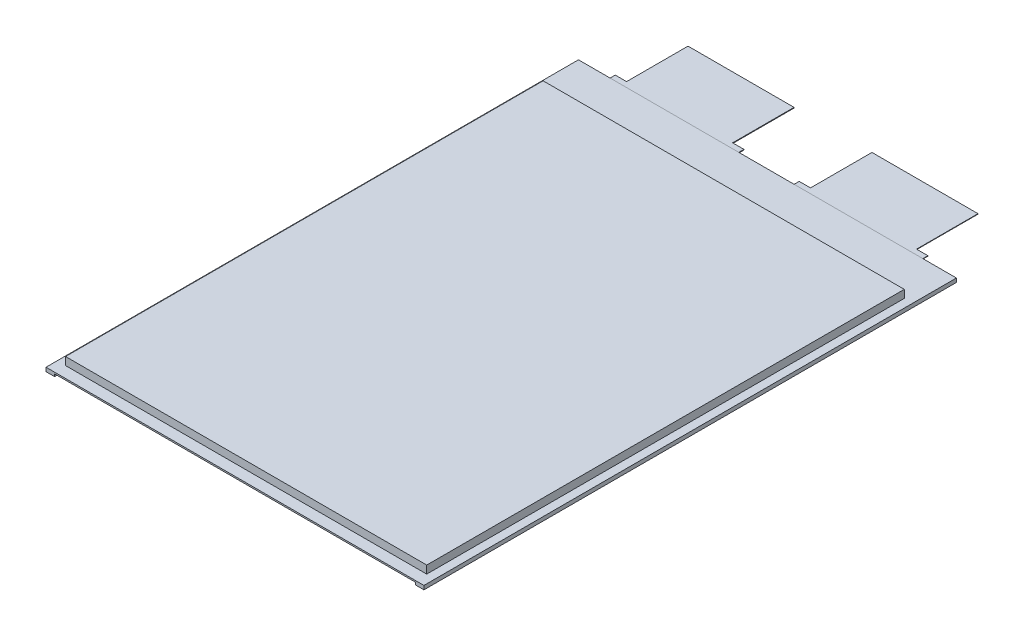
ISO-10303-21;
HEADER;
FILE_DESCRIPTION(('STEP AP214'),'2;1');
FILE_NAME('part.step','',(''),(''),'','','');
FILE_SCHEMA(('AUTOMOTIVE_DESIGN { 1 0 10303 214 1 1 1 1 }'));
ENDSEC;
DATA;
#1=APPLICATION_CONTEXT('core data for automotive mechanical design processes');
#2=APPLICATION_PROTOCOL_DEFINITION('international standard','automotive_design',2000,#1);
#3=PRODUCT_CONTEXT('',#1,'mechanical');
#4=PRODUCT('Part','Part','',(#3));
#5=PRODUCT_RELATED_PRODUCT_CATEGORY('part','',(#4));
#6=PRODUCT_DEFINITION_FORMATION('','',#4);
#7=PRODUCT_DEFINITION_CONTEXT('part definition',#1,'design');
#8=PRODUCT_DEFINITION('design','',#6,#7);
#9=PRODUCT_DEFINITION_SHAPE('','',#8);
#10=(LENGTH_UNIT() NAMED_UNIT(*) SI_UNIT(.MILLI.,.METRE.));
#11=(NAMED_UNIT(*) PLANE_ANGLE_UNIT() SI_UNIT($,.RADIAN.));
#12=(NAMED_UNIT(*) SI_UNIT($,.STERADIAN.) SOLID_ANGLE_UNIT());
#13=UNCERTAINTY_MEASURE_WITH_UNIT(LENGTH_MEASURE(1.E-05),#10,'distance_accuracy_value','');
#14=(GEOMETRIC_REPRESENTATION_CONTEXT(3) GLOBAL_UNCERTAINTY_ASSIGNED_CONTEXT((#13)) GLOBAL_UNIT_ASSIGNED_CONTEXT((#10,
#11,#12)) REPRESENTATION_CONTEXT('',''));
#15=CARTESIAN_POINT('',(0.,0.,0.));
#16=DIRECTION('',(0.,0.,1.));
#17=DIRECTION('',(1.,0.,0.));
#18=AXIS2_PLACEMENT_3D('',#15,#16,#17);
#19=CARTESIAN_POINT('',(0.,-0.3175,0.));
#20=DIRECTION('',(0.,1.,0.));
#21=DIRECTION('',(0.,0.,1.));
#22=AXIS2_PLACEMENT_3D('',#19,#20,#21);
#23=PLANE('',#22);
#24=DIRECTION('',(1.,0.,0.));
#25=VECTOR('',#24,1.);
#26=CARTESIAN_POINT('',(0.,-0.3175,-227.0125));
#27=LINE('',#26,#25);
#28=CARTESIAN_POINT('',(3.683,-0.3175,-227.0125));
#29=VERTEX_POINT('',#28);
#30=CARTESIAN_POINT('',(157.44825,-0.3175,-227.0125));
#31=VERTEX_POINT('',#30);
#32=EDGE_CURVE('E509',#29,#31,#27,.T.);
#33=ORIENTED_EDGE('',*,*,#32,.T.);
#34=DIRECTION('',(0.,0.,1.));
#35=VECTOR('',#34,1.);
#36=CARTESIAN_POINT('',(157.44825,-0.3175,-227.0125));
#37=LINE('',#36,#35);
#38=CARTESIAN_POINT('',(157.44825,-0.3175,-208.359375));
#39=VERTEX_POINT('',#38);
#40=EDGE_CURVE('E289',#31,#39,#37,.T.);
#41=ORIENTED_EDGE('',*,*,#40,.T.);
#42=DIRECTION('',(1.,0.,0.));
#43=VECTOR('',#42,1.);
#44=CARTESIAN_POINT('',(0.,-0.3175,-208.359375));
#45=LINE('',#44,#43);
#46=CARTESIAN_POINT('',(3.683,-0.3175,-208.359375));
#47=VERTEX_POINT('',#46);
#48=EDGE_CURVE('E528',#47,#39,#45,.T.);
#49=ORIENTED_EDGE('',*,*,#48,.F.);
#50=DIRECTION('',(0.,0.,1.));
#51=VECTOR('',#50,1.);
#52=CARTESIAN_POINT('',(3.683,-0.3175,-227.0125));
#53=LINE('',#52,#51);
#54=EDGE_CURVE('E320',#29,#47,#53,.T.);
#55=ORIENTED_EDGE('',*,*,#54,.F.);
#56=EDGE_LOOP('',(#33,#41,#49,#55));
#57=FACE_BOUND('',#56,.T.);
#58=ADVANCED_FACE('F36',(#57),#23,.F.);
#59=CARTESIAN_POINT('',(157.559375,-3.4163,0.));
#60=DIRECTION('',(1.,0.,0.));
#61=DIRECTION('',(0.,0.,-1.));
#62=AXIS2_PLACEMENT_3D('',#59,#60,#61);
#63=PLANE('',#62);
#64=DIRECTION('',(0.,1.,0.));
#65=VECTOR('',#64,1.);
#66=CARTESIAN_POINT('',(157.559375,-3.4163,-208.359375));
#67=LINE('',#66,#65);
#68=CARTESIAN_POINT('',(157.559375,-3.4163,-208.359375));
#69=VERTEX_POINT('',#68);
#70=CARTESIAN_POINT('',(157.559375,-1.3335,-208.359375));
#71=VERTEX_POINT('',#70);
#72=EDGE_CURVE('E498',#69,#71,#67,.T.);
#73=ORIENTED_EDGE('',*,*,#72,.T.);
#74=DIRECTION('',(0.,0.,1.));
#75=VECTOR('',#74,1.);
#76=CARTESIAN_POINT('',(157.559375,-1.3335,0.));
#77=LINE('',#76,#75);
#78=CARTESIAN_POINT('',(157.559375,-1.3335,-4.7625));
#79=VERTEX_POINT('',#78);
#80=EDGE_CURVE('E11',#71,#79,#77,.T.);
#81=ORIENTED_EDGE('',*,*,#80,.T.);
#82=DIRECTION('',(0.,1.,0.));
#83=VECTOR('',#82,1.);
#84=CARTESIAN_POINT('',(157.559375,-3.4163,-4.7625));
#85=LINE('',#84,#83);
#86=CARTESIAN_POINT('',(157.559375,-3.4163,-4.7625));
#87=VERTEX_POINT('',#86);
#88=EDGE_CURVE('E502',#87,#79,#85,.T.);
#89=ORIENTED_EDGE('',*,*,#88,.F.);
#90=DIRECTION('',(0.,0.,-1.));
#91=VECTOR('',#90,1.);
#92=CARTESIAN_POINT('',(157.559375,-3.4163,0.));
#93=LINE('',#92,#91);
#94=EDGE_CURVE('E481',#87,#69,#93,.T.);
#95=ORIENTED_EDGE('',*,*,#94,.T.);
#96=EDGE_LOOP('',(#73,#81,#89,#95));
#97=FACE_BOUND('',#96,.T.);
#98=ADVANCED_FACE('F583',(#97),#63,.T.);
#99=DIRECTION('',(1.,0.,0.));
#100=VECTOR('',#99,1.);
#101=CARTESIAN_POINT('',(0.,-0.3175,-4.7625));
#102=LINE('',#101,#100);
#103=CARTESIAN_POINT('',(3.683,-0.3175,-4.7625));
#104=VERTEX_POINT('',#103);
#105=CARTESIAN_POINT('',(157.44825,-0.3175,-4.7625));
#106=VERTEX_POINT('',#105);
#107=EDGE_CURVE('E492',#104,#106,#102,.T.);
#108=ORIENTED_EDGE('',*,*,#107,.T.);
#109=CARTESIAN_POINT('',(157.44825,-0.3175,0.));
#110=VERTEX_POINT('',#109);
#111=EDGE_CURVE('E304',#106,#110,#37,.T.);
#112=ORIENTED_EDGE('',*,*,#111,.T.);
#113=DIRECTION('',(1.,0.,0.));
#114=VECTOR('',#113,1.);
#115=CARTESIAN_POINT('',(0.,-0.3175,0.));
#116=LINE('',#115,#114);
#117=CARTESIAN_POINT('',(3.683,-0.3175,0.));
#118=VERTEX_POINT('',#117);
#119=EDGE_CURVE('E531',#118,#110,#116,.T.);
#120=ORIENTED_EDGE('',*,*,#119,.F.);
#121=EDGE_CURVE('E315',#104,#118,#53,.T.);
#122=ORIENTED_EDGE('',*,*,#121,.F.);
#123=EDGE_LOOP('',(#108,#112,#120,#122));
#124=FACE_BOUND('',#123,.T.);
#125=ADVANCED_FACE('F551',(#124),#23,.F.);
#126=CARTESIAN_POINT('',(0.,-3.4163,-208.359375));
#127=DIRECTION('',(0.,0.,1.));
#128=DIRECTION('',(1.,0.,0.));
#129=AXIS2_PLACEMENT_3D('',#126,#127,#128);
#130=PLANE('',#129);
#131=ORIENTED_EDGE('',*,*,#48,.T.);
#132=DIRECTION('',(0.,-1.,0.));
#133=VECTOR('',#132,1.);
#134=CARTESIAN_POINT('',(157.44825,-3.4163,-208.359375));
#135=LINE('',#134,#133);
#136=CARTESIAN_POINT('',(157.44825,-1.3335,-208.359375));
#137=VERTEX_POINT('',#136);
#138=EDGE_CURVE('E312',#39,#137,#135,.T.);
#139=ORIENTED_EDGE('',*,*,#138,.T.);
#140=DIRECTION('',(-1.,0.,0.));
#141=VECTOR('',#140,1.);
#142=CARTESIAN_POINT('',(0.,-1.3335,-208.359375));
#143=LINE('',#142,#141);
#144=EDGE_CURVE('E308',#71,#137,#143,.T.);
#145=ORIENTED_EDGE('',*,*,#144,.F.);
#146=ORIENTED_EDGE('',*,*,#72,.F.);
#147=DIRECTION('',(1.,0.,0.));
#148=VECTOR('',#147,1.);
#149=CARTESIAN_POINT('',(0.,-3.4163,-208.359375));
#150=LINE('',#149,#148);
#151=CARTESIAN_POINT('',(3.571875,-3.4163,-208.359375));
#152=VERTEX_POINT('',#151);
#153=EDGE_CURVE('E484',#152,#69,#150,.T.);
#154=ORIENTED_EDGE('',*,*,#153,.F.);
#155=DIRECTION('',(0.,1.,0.));
#156=VECTOR('',#155,1.);
#157=CARTESIAN_POINT('',(3.571875,-3.4163,-208.359375));
#158=LINE('',#157,#156);
#159=CARTESIAN_POINT('',(3.571875,-1.3335,-208.359375));
#160=VERTEX_POINT('',#159);
#161=EDGE_CURVE('E494',#152,#160,#158,.T.);
#162=ORIENTED_EDGE('',*,*,#161,.T.);
#163=DIRECTION('',(-1.,0.,0.));
#164=VECTOR('',#163,1.);
#165=CARTESIAN_POINT('',(0.,-1.3335,-208.359375));
#166=LINE('',#165,#164);
#167=CARTESIAN_POINT('',(3.683,-1.3335,-208.359375));
#168=VERTEX_POINT('',#167);
#169=EDGE_CURVE('E336',#168,#160,#166,.T.);
#170=ORIENTED_EDGE('',*,*,#169,.F.);
#171=DIRECTION('',(0.,-1.,0.));
#172=VECTOR('',#171,1.);
#173=CARTESIAN_POINT('',(3.683,-3.4163,-208.359375));
#174=LINE('',#173,#172);
#175=EDGE_CURVE('E338',#47,#168,#174,.T.);
#176=ORIENTED_EDGE('',*,*,#175,.F.);
#177=EDGE_LOOP('',(#131,#139,#145,#146,#154,#162,#170,#176));
#178=FACE_BOUND('',#177,.T.);
#179=ADVANCED_FACE('F570',(#178),#130,.F.);
#180=CARTESIAN_POINT('',(3.571875,-3.4163,0.));
#181=DIRECTION('',(1.,0.,0.));
#182=DIRECTION('',(0.,0.,-1.));
#183=AXIS2_PLACEMENT_3D('',#180,#181,#182);
#184=PLANE('',#183);
#185=DIRECTION('',(0.,0.,1.));
#186=VECTOR('',#185,1.);
#187=CARTESIAN_POINT('',(3.571875,-1.3335,0.));
#188=LINE('',#187,#186);
#189=CARTESIAN_POINT('',(3.571875,-1.3335,-4.7625));
#190=VERTEX_POINT('',#189);
#191=EDGE_CURVE('E58',#160,#190,#188,.T.);
#192=ORIENTED_EDGE('',*,*,#191,.F.);
#193=ORIENTED_EDGE('',*,*,#161,.F.);
#194=DIRECTION('',(0.,0.,-1.));
#195=VECTOR('',#194,1.);
#196=CARTESIAN_POINT('',(3.571875,-3.4163,0.));
#197=LINE('',#196,#195);
#198=CARTESIAN_POINT('',(3.571875,-3.4163,-4.7625));
#199=VERTEX_POINT('',#198);
#200=EDGE_CURVE('E486',#199,#152,#197,.T.);
#201=ORIENTED_EDGE('',*,*,#200,.F.);
#202=DIRECTION('',(0.,1.,0.));
#203=VECTOR('',#202,1.);
#204=CARTESIAN_POINT('',(3.571875,-3.4163,-4.7625));
#205=LINE('',#204,#203);
#206=EDGE_CURVE('E489',#199,#190,#205,.T.);
#207=ORIENTED_EDGE('',*,*,#206,.T.);
#208=EDGE_LOOP('',(#192,#193,#201,#207));
#209=FACE_BOUND('',#208,.T.);
#210=ADVANCED_FACE('F577',(#209),#184,.F.);
#211=CARTESIAN_POINT('',(0.,-3.4163,-4.7625));
#212=DIRECTION('',(0.,0.,1.));
#213=DIRECTION('',(1.,0.,0.));
#214=AXIS2_PLACEMENT_3D('',#211,#212,#213);
#215=PLANE('',#214);
#216=DIRECTION('',(0.,-1.,0.));
#217=VECTOR('',#216,1.);
#218=CARTESIAN_POINT('',(157.44825,-3.4163,-4.7625));
#219=LINE('',#218,#217);
#220=CARTESIAN_POINT('',(157.44825,-1.3335,-4.7625));
#221=VERTEX_POINT('',#220);
#222=EDGE_CURVE('E310',#106,#221,#219,.T.);
#223=ORIENTED_EDGE('',*,*,#222,.F.);
#224=ORIENTED_EDGE('',*,*,#107,.F.);
#225=DIRECTION('',(0.,-1.,0.));
#226=VECTOR('',#225,1.);
#227=CARTESIAN_POINT('',(3.683,-3.4163,-4.7625));
#228=LINE('',#227,#226);
#229=CARTESIAN_POINT('',(3.683,-1.3335,-4.7625));
#230=VERTEX_POINT('',#229);
#231=EDGE_CURVE('E44',#104,#230,#228,.T.);
#232=ORIENTED_EDGE('',*,*,#231,.T.);
#233=DIRECTION('',(-1.,0.,0.));
#234=VECTOR('',#233,1.);
#235=CARTESIAN_POINT('',(0.,-1.3335,-4.7625));
#236=LINE('',#235,#234);
#237=EDGE_CURVE('E280',#230,#190,#236,.T.);
#238=ORIENTED_EDGE('',*,*,#237,.T.);
#239=ORIENTED_EDGE('',*,*,#206,.F.);
#240=DIRECTION('',(1.,0.,0.));
#241=VECTOR('',#240,1.);
#242=CARTESIAN_POINT('',(0.,-3.4163,-4.7625));
#243=LINE('',#242,#241);
#244=EDGE_CURVE('E478',#199,#87,#243,.T.);
#245=ORIENTED_EDGE('',*,*,#244,.T.);
#246=ORIENTED_EDGE('',*,*,#88,.T.);
#247=DIRECTION('',(-1.,0.,0.));
#248=VECTOR('',#247,1.);
#249=CARTESIAN_POINT('',(0.,-1.3335,-4.7625));
#250=LINE('',#249,#248);
#251=EDGE_CURVE('E51',#79,#221,#250,.T.);
#252=ORIENTED_EDGE('',*,*,#251,.T.);
#253=EDGE_LOOP('',(#223,#224,#232,#238,#239,#245,#246,#252));
#254=FACE_BOUND('',#253,.T.);
#255=ADVANCED_FACE('F543',(#254),#215,.T.);
#256=CARTESIAN_POINT('',(0.,0.3175,0.));
#257=DIRECTION('',(0.,0.,-1.));
#258=DIRECTION('',(-1.,0.,0.));
#259=AXIS2_PLACEMENT_3D('',#256,#257,#258);
#260=PLANE('',#259);
#261=DIRECTION('',(0.,-1.,0.));
#262=VECTOR('',#261,1.);
#263=CARTESIAN_POINT('',(0.,0.3175,0.));
#264=LINE('',#263,#262);
#265=CARTESIAN_POINT('',(0.,0.3175,0.));
#266=VERTEX_POINT('',#265);
#267=CARTESIAN_POINT('',(0.,-1.3335,0.));
#268=VERTEX_POINT('',#267);
#269=EDGE_CURVE('E525',#266,#268,#264,.T.);
#270=ORIENTED_EDGE('',*,*,#269,.T.);
#271=DIRECTION('',(-1.,0.,0.));
#272=VECTOR('',#271,1.);
#273=CARTESIAN_POINT('',(0.,-1.3335,0.));
#274=LINE('',#273,#272);
#275=CARTESIAN_POINT('',(3.683,-1.3335,0.));
#276=VERTEX_POINT('',#275);
#277=EDGE_CURVE('E326',#276,#268,#274,.T.);
#278=ORIENTED_EDGE('',*,*,#277,.F.);
#279=DIRECTION('',(0.,1.,0.));
#280=VECTOR('',#279,1.);
#281=CARTESIAN_POINT('',(3.683,-1.3335,0.));
#282=LINE('',#281,#280);
#283=EDGE_CURVE('E329',#276,#118,#282,.T.);
#284=ORIENTED_EDGE('',*,*,#283,.T.);
#285=ORIENTED_EDGE('',*,*,#119,.T.);
#286=DIRECTION('',(0.,1.,0.));
#287=VECTOR('',#286,1.);
#288=CARTESIAN_POINT('',(157.44825,-1.3335,0.));
#289=LINE('',#288,#287);
#290=CARTESIAN_POINT('',(157.44825,-1.3335,0.));
#291=VERTEX_POINT('',#290);
#292=EDGE_CURVE('E293',#291,#110,#289,.T.);
#293=ORIENTED_EDGE('',*,*,#292,.F.);
#294=DIRECTION('',(1.,0.,0.));
#295=VECTOR('',#294,1.);
#296=CARTESIAN_POINT('',(161.13125,-1.3335,0.));
#297=LINE('',#296,#295);
#298=CARTESIAN_POINT('',(161.13125,-1.3335,0.));
#299=VERTEX_POINT('',#298);
#300=EDGE_CURVE('E285',#291,#299,#297,.T.);
#301=ORIENTED_EDGE('',*,*,#300,.T.);
#302=DIRECTION('',(0.,-1.,0.));
#303=VECTOR('',#302,1.);
#304=CARTESIAN_POINT('',(161.13125,0.3175,0.));
#305=LINE('',#304,#303);
#306=CARTESIAN_POINT('',(161.13125,0.3175,0.));
#307=VERTEX_POINT('',#306);
#308=EDGE_CURVE('E269',#307,#299,#305,.T.);
#309=ORIENTED_EDGE('',*,*,#308,.F.);
#310=DIRECTION('',(1.,0.,0.));
#311=VECTOR('',#310,1.);
#312=CARTESIAN_POINT('',(0.,0.3175,0.));
#313=LINE('',#312,#311);
#314=EDGE_CURVE('E516',#266,#307,#313,.T.);
#315=ORIENTED_EDGE('',*,*,#314,.F.);
#316=EDGE_LOOP('',(#270,#278,#284,#285,#293,#301,#309,#315));
#317=FACE_BOUND('',#316,.T.);
#318=ADVANCED_FACE('F38',(#317),#260,.F.);
#319=CARTESIAN_POINT('',(161.13125,0.3175,0.));
#320=DIRECTION('',(-1.,0.,0.));
#321=DIRECTION('',(0.,0.,1.));
#322=AXIS2_PLACEMENT_3D('',#319,#320,#321);
#323=PLANE('',#322);
#324=ORIENTED_EDGE('',*,*,#308,.T.);
#325=DIRECTION('',(0.,0.,-1.));
#326=VECTOR('',#325,1.);
#327=CARTESIAN_POINT('',(161.13125,-1.3335,-227.0125));
#328=LINE('',#327,#326);
#329=CARTESIAN_POINT('',(161.13125,-1.3335,-227.0125));
#330=VERTEX_POINT('',#329);
#331=EDGE_CURVE('E273',#299,#330,#328,.T.);
#332=ORIENTED_EDGE('',*,*,#331,.T.);
#333=DIRECTION('',(0.,-1.,0.));
#334=VECTOR('',#333,1.);
#335=CARTESIAN_POINT('',(161.13125,0.3175,-227.0125));
#336=LINE('',#335,#334);
#337=CARTESIAN_POINT('',(161.13125,0.3175,-227.0125));
#338=VERTEX_POINT('',#337);
#339=EDGE_CURVE('E281',#338,#330,#336,.T.);
#340=ORIENTED_EDGE('',*,*,#339,.F.);
#341=DIRECTION('',(0.,0.,-1.));
#342=VECTOR('',#341,1.);
#343=CARTESIAN_POINT('',(161.13125,0.3175,0.));
#344=LINE('',#343,#342);
#345=EDGE_CURVE('E275',#307,#338,#344,.T.);
#346=ORIENTED_EDGE('',*,*,#345,.F.);
#347=EDGE_LOOP('',(#324,#332,#340,#346));
#348=FACE_BOUND('',#347,.T.);
#349=ADVANCED_FACE('F271',(#348),#323,.F.);
#350=CARTESIAN_POINT('',(0.,0.3175,-227.0125));
#351=DIRECTION('',(0.,0.,-1.));
#352=DIRECTION('',(-1.,0.,0.));
#353=AXIS2_PLACEMENT_3D('',#350,#351,#352);
#354=PLANE('',#353);
#355=DIRECTION('',(1.,0.,0.));
#356=VECTOR('',#355,1.);
#357=CARTESIAN_POINT('',(0.,0.1397,-227.0125));
#358=LINE('',#357,#356);
#359=CARTESIAN_POINT('',(13.30325,0.1397,-227.0125));
#360=VERTEX_POINT('',#359);
#361=CARTESIAN_POINT('',(68.16725,0.1397,-227.0125));
#362=VERTEX_POINT('',#361);
#363=EDGE_CURVE('E351',#360,#362,#358,.T.);
#364=ORIENTED_EDGE('',*,*,#363,.F.);
#365=DIRECTION('',(0.,-1.,0.));
#366=VECTOR('',#365,1.);
#367=CARTESIAN_POINT('',(13.30325,0.1397,-227.0125));
#368=LINE('',#367,#366);
#369=CARTESIAN_POINT('',(13.30325,-0.1397,-227.0125));
#370=VERTEX_POINT('',#369);
#371=EDGE_CURVE('E396',#360,#370,#368,.T.);
#372=ORIENTED_EDGE('',*,*,#371,.T.);
#373=DIRECTION('',(1.,0.,0.));
#374=VECTOR('',#373,1.);
#375=CARTESIAN_POINT('',(0.,-0.1397,-227.0125));
#376=LINE('',#375,#374);
#377=CARTESIAN_POINT('',(68.16725,-0.1397,-227.0125));
#378=VERTEX_POINT('',#377);
#379=EDGE_CURVE('E372',#370,#378,#376,.T.);
#380=ORIENTED_EDGE('',*,*,#379,.T.);
#381=DIRECTION('',(0.,-1.,0.));
#382=VECTOR('',#381,1.);
#383=CARTESIAN_POINT('',(68.16725,0.1397,-227.0125));
#384=LINE('',#383,#382);
#385=EDGE_CURVE('E393',#362,#378,#384,.T.);
#386=ORIENTED_EDGE('',*,*,#385,.F.);
#387=EDGE_LOOP('',(#364,#372,#380,#386));
#388=FACE_BOUND('',#387,.T.);
#389=DIRECTION('',(1.,0.,0.));
#390=VECTOR('',#389,1.);
#391=CARTESIAN_POINT('',(0.,0.1016,-227.0125));
#392=LINE('',#391,#390);
#393=CARTESIAN_POINT('',(91.72575,0.1016,-227.0125));
#394=VERTEX_POINT('',#393);
#395=CARTESIAN_POINT('',(146.58975,0.1016,-227.0125));
#396=VERTEX_POINT('',#395);
#397=EDGE_CURVE('E414',#394,#396,#392,.T.);
#398=ORIENTED_EDGE('',*,*,#397,.F.);
#399=DIRECTION('',(0.,-1.,0.));
#400=VECTOR('',#399,1.);
#401=CARTESIAN_POINT('',(91.72575,0.1016,-227.0125));
#402=LINE('',#401,#400);
#403=CARTESIAN_POINT('',(91.72575,-0.1016,-227.0125));
#404=VERTEX_POINT('',#403);
#405=EDGE_CURVE('E459',#394,#404,#402,.T.);
#406=ORIENTED_EDGE('',*,*,#405,.T.);
#407=DIRECTION('',(1.,0.,0.));
#408=VECTOR('',#407,1.);
#409=CARTESIAN_POINT('',(0.,-0.1016,-227.0125));
#410=LINE('',#409,#408);
#411=CARTESIAN_POINT('',(146.58975,-0.1016,-227.0125));
#412=VERTEX_POINT('',#411);
#413=EDGE_CURVE('E435',#404,#412,#410,.T.);
#414=ORIENTED_EDGE('',*,*,#413,.T.);
#415=DIRECTION('',(0.,-1.,0.));
#416=VECTOR('',#415,1.);
#417=CARTESIAN_POINT('',(146.58975,0.1016,-227.0125));
#418=LINE('',#417,#416);
#419=EDGE_CURVE('E456',#396,#412,#418,.T.);
#420=ORIENTED_EDGE('',*,*,#419,.F.);
#421=EDGE_LOOP('',(#398,#406,#414,#420));
#422=FACE_BOUND('',#421,.T.);
#423=ORIENTED_EDGE('',*,*,#32,.F.);
#424=DIRECTION('',(0.,1.,0.));
#425=VECTOR('',#424,1.);
#426=CARTESIAN_POINT('',(3.683,-1.3335,-227.0125));
#427=LINE('',#426,#425);
#428=CARTESIAN_POINT('',(3.683,-1.3335,-227.0125));
#429=VERTEX_POINT('',#428);
#430=EDGE_CURVE('E333',#429,#29,#427,.T.);
#431=ORIENTED_EDGE('',*,*,#430,.F.);
#432=DIRECTION('',(1.,0.,0.));
#433=VECTOR('',#432,1.);
#434=CARTESIAN_POINT('',(0.,-1.3335,-227.0125));
#435=LINE('',#434,#433);
#436=CARTESIAN_POINT('',(0.,-1.3335,-227.0125));
#437=VERTEX_POINT('',#436);
#438=EDGE_CURVE('E319',#437,#429,#435,.T.);
#439=ORIENTED_EDGE('',*,*,#438,.F.);
#440=DIRECTION('',(0.,-1.,0.));
#441=VECTOR('',#440,1.);
#442=CARTESIAN_POINT('',(0.,0.3175,-227.0125));
#443=LINE('',#442,#441);
#444=CARTESIAN_POINT('',(0.,0.3175,-227.0125));
#445=VERTEX_POINT('',#444);
#446=EDGE_CURVE('E536',#445,#437,#443,.T.);
#447=ORIENTED_EDGE('',*,*,#446,.F.);
#448=DIRECTION('',(1.,0.,0.));
#449=VECTOR('',#448,1.);
#450=CARTESIAN_POINT('',(0.,0.3175,-227.0125));
#451=LINE('',#450,#449);
#452=EDGE_CURVE('E519',#445,#338,#451,.T.);
#453=ORIENTED_EDGE('',*,*,#452,.T.);
#454=ORIENTED_EDGE('',*,*,#339,.T.);
#455=DIRECTION('',(-1.,0.,0.));
#456=VECTOR('',#455,1.);
#457=CARTESIAN_POINT('',(161.13125,-1.3335,-227.0125));
#458=LINE('',#457,#456);
#459=CARTESIAN_POINT('',(157.44825,-1.3335,-227.0125));
#460=VERTEX_POINT('',#459);
#461=EDGE_CURVE('E288',#330,#460,#458,.T.);
#462=ORIENTED_EDGE('',*,*,#461,.T.);
#463=DIRECTION('',(0.,1.,0.));
#464=VECTOR('',#463,1.);
#465=CARTESIAN_POINT('',(157.44825,-1.3335,-227.0125));
#466=LINE('',#465,#464);
#467=EDGE_CURVE('E301',#460,#31,#466,.T.);
#468=ORIENTED_EDGE('',*,*,#467,.T.);
#469=EDGE_LOOP('',(#423,#431,#439,#447,#453,#454,#462,#468));
#470=FACE_BOUND('',#469,.T.);
#471=ADVANCED_FACE('F564',(#388,#422,#470),#354,.T.);
#472=CARTESIAN_POINT('',(0.,0.3175,0.));
#473=DIRECTION('',(-1.,0.,0.));
#474=DIRECTION('',(0.,0.,1.));
#475=AXIS2_PLACEMENT_3D('',#472,#473,#474);
#476=PLANE('',#475);
#477=ORIENTED_EDGE('',*,*,#446,.T.);
#478=DIRECTION('',(0.,0.,-1.));
#479=VECTOR('',#478,1.);
#480=CARTESIAN_POINT('',(0.,-1.3335,-227.0125));
#481=LINE('',#480,#479);
#482=EDGE_CURVE('E316',#268,#437,#481,.T.);
#483=ORIENTED_EDGE('',*,*,#482,.F.);
#484=ORIENTED_EDGE('',*,*,#269,.F.);
#485=DIRECTION('',(0.,0.,-1.));
#486=VECTOR('',#485,1.);
#487=CARTESIAN_POINT('',(0.,0.3175,0.));
#488=LINE('',#487,#486);
#489=EDGE_CURVE('E522',#266,#445,#488,.T.);
#490=ORIENTED_EDGE('',*,*,#489,.T.);
#491=EDGE_LOOP('',(#477,#483,#484,#490));
#492=FACE_BOUND('',#491,.T.);
#493=ADVANCED_FACE('F557',(#492),#476,.T.);
#494=CARTESIAN_POINT('',(0.,0.3175,0.));
#495=DIRECTION('',(0.,1.,0.));
#496=DIRECTION('',(0.,0.,1.));
#497=AXIS2_PLACEMENT_3D('',#494,#495,#496);
#498=PLANE('',#497);
#499=DIRECTION('',(0.,0.,-1.));
#500=VECTOR('',#499,1.);
#501=CARTESIAN_POINT('',(157.559375,0.3175,0.));
#502=LINE('',#501,#500);
#503=CARTESIAN_POINT('',(157.559375,0.3175,-4.7625));
#504=VERTEX_POINT('',#503);
#505=CARTESIAN_POINT('',(157.559375,0.3175,-208.359375));
#506=VERTEX_POINT('',#505);
#507=EDGE_CURVE('E505',#504,#506,#502,.T.);
#508=ORIENTED_EDGE('',*,*,#507,.F.);
#509=DIRECTION('',(1.,0.,0.));
#510=VECTOR('',#509,1.);
#511=CARTESIAN_POINT('',(0.,0.3175,-4.7625));
#512=LINE('',#511,#510);
#513=CARTESIAN_POINT('',(3.571875,0.3175,-4.7625));
#514=VERTEX_POINT('',#513);
#515=EDGE_CURVE('E508',#514,#504,#512,.T.);
#516=ORIENTED_EDGE('',*,*,#515,.F.);
#517=DIRECTION('',(0.,0.,-1.));
#518=VECTOR('',#517,1.);
#519=CARTESIAN_POINT('',(3.571875,0.3175,0.));
#520=LINE('',#519,#518);
#521=CARTESIAN_POINT('',(3.571875,0.3175,-208.359375));
#522=VERTEX_POINT('',#521);
#523=EDGE_CURVE('E512',#514,#522,#520,.T.);
#524=ORIENTED_EDGE('',*,*,#523,.T.);
#525=DIRECTION('',(1.,0.,0.));
#526=VECTOR('',#525,1.);
#527=CARTESIAN_POINT('',(0.,0.3175,-208.359375));
#528=LINE('',#527,#526);
#529=EDGE_CURVE('E514',#522,#506,#528,.T.);
#530=ORIENTED_EDGE('',*,*,#529,.T.);
#531=EDGE_LOOP('',(#508,#516,#524,#530));
#532=FACE_BOUND('',#531,.T.);
#533=ORIENTED_EDGE('',*,*,#314,.T.);
#534=ORIENTED_EDGE('',*,*,#345,.T.);
#535=ORIENTED_EDGE('',*,*,#452,.F.);
#536=ORIENTED_EDGE('',*,*,#489,.F.);
#537=EDGE_LOOP('',(#533,#534,#535,#536));
#538=FACE_BOUND('',#537,.T.);
#539=ADVANCED_FACE('F591',(#532,#538),#498,.T.);
#540=CARTESIAN_POINT('',(0.,-3.4163,0.));
#541=DIRECTION('',(0.,1.,0.));
#542=DIRECTION('',(0.,0.,1.));
#543=AXIS2_PLACEMENT_3D('',#540,#541,#542);
#544=PLANE('',#543);
#545=ORIENTED_EDGE('',*,*,#244,.F.);
#546=ORIENTED_EDGE('',*,*,#200,.T.);
#547=ORIENTED_EDGE('',*,*,#153,.T.);
#548=ORIENTED_EDGE('',*,*,#94,.F.);
#549=EDGE_LOOP('',(#545,#546,#547,#548));
#550=FACE_BOUND('',#549,.T.);
#551=ADVANCED_FACE('F581',(#550),#544,.F.);
#552=CARTESIAN_POINT('',(3.571875,3.6703,-4.7625));
#553=VERTEX_POINT('',#552);
#554=EDGE_CURVE('E493',#514,#553,#205,.T.);
#555=ORIENTED_EDGE('',*,*,#554,.F.);
#556=ORIENTED_EDGE('',*,*,#515,.T.);
#557=CARTESIAN_POINT('',(157.559375,3.6703,-4.7625));
#558=VERTEX_POINT('',#557);
#559=EDGE_CURVE('E488',#504,#558,#85,.T.);
#560=ORIENTED_EDGE('',*,*,#559,.T.);
#561=DIRECTION('',(1.,0.,0.));
#562=VECTOR('',#561,1.);
#563=CARTESIAN_POINT('',(0.,3.6703,-4.7625));
#564=LINE('',#563,#562);
#565=EDGE_CURVE('E466',#553,#558,#564,.T.);
#566=ORIENTED_EDGE('',*,*,#565,.F.);
#567=EDGE_LOOP('',(#555,#556,#560,#566));
#568=FACE_BOUND('',#567,.T.);
#569=ADVANCED_FACE('F599',(#568),#215,.T.);
#570=ORIENTED_EDGE('',*,*,#523,.F.);
#571=ORIENTED_EDGE('',*,*,#554,.T.);
#572=DIRECTION('',(0.,0.,-1.));
#573=VECTOR('',#572,1.);
#574=CARTESIAN_POINT('',(3.571875,3.6703,0.));
#575=LINE('',#574,#573);
#576=CARTESIAN_POINT('',(3.571875,3.6703,-208.359375));
#577=VERTEX_POINT('',#576);
#578=EDGE_CURVE('E475',#553,#577,#575,.T.);
#579=ORIENTED_EDGE('',*,*,#578,.T.);
#580=EDGE_CURVE('E497',#522,#577,#158,.T.);
#581=ORIENTED_EDGE('',*,*,#580,.F.);
#582=EDGE_LOOP('',(#570,#571,#579,#581));
#583=FACE_BOUND('',#582,.T.);
#584=ADVANCED_FACE('F620',(#583),#184,.F.);
#585=ORIENTED_EDGE('',*,*,#529,.F.);
#586=ORIENTED_EDGE('',*,*,#580,.T.);
#587=DIRECTION('',(1.,0.,0.));
#588=VECTOR('',#587,1.);
#589=CARTESIAN_POINT('',(0.,3.6703,-208.359375));
#590=LINE('',#589,#588);
#591=CARTESIAN_POINT('',(157.559375,3.6703,-208.359375));
#592=VERTEX_POINT('',#591);
#593=EDGE_CURVE('E472',#577,#592,#590,.T.);
#594=ORIENTED_EDGE('',*,*,#593,.T.);
#595=EDGE_CURVE('E501',#506,#592,#67,.T.);
#596=ORIENTED_EDGE('',*,*,#595,.F.);
#597=EDGE_LOOP('',(#585,#586,#594,#596));
#598=FACE_BOUND('',#597,.T.);
#599=ADVANCED_FACE('F615',(#598),#130,.F.);
#600=ORIENTED_EDGE('',*,*,#559,.F.);
#601=ORIENTED_EDGE('',*,*,#507,.T.);
#602=ORIENTED_EDGE('',*,*,#595,.T.);
#603=DIRECTION('',(0.,0.,-1.));
#604=VECTOR('',#603,1.);
#605=CARTESIAN_POINT('',(157.559375,3.6703,0.));
#606=LINE('',#605,#604);
#607=EDGE_CURVE('E469',#558,#592,#606,.T.);
#608=ORIENTED_EDGE('',*,*,#607,.F.);
#609=EDGE_LOOP('',(#600,#601,#602,#608));
#610=FACE_BOUND('',#609,.T.);
#611=ADVANCED_FACE('F609',(#610),#63,.T.);
#612=CARTESIAN_POINT('',(0.,3.6703,0.));
#613=DIRECTION('',(0.,1.,0.));
#614=DIRECTION('',(0.,0.,1.));
#615=AXIS2_PLACEMENT_3D('',#612,#613,#614);
#616=PLANE('',#615);
#617=ORIENTED_EDGE('',*,*,#565,.T.);
#618=ORIENTED_EDGE('',*,*,#607,.T.);
#619=ORIENTED_EDGE('',*,*,#593,.F.);
#620=ORIENTED_EDGE('',*,*,#578,.F.);
#621=EDGE_LOOP('',(#617,#618,#619,#620));
#622=FACE_BOUND('',#621,.T.);
#623=ADVANCED_FACE('F627',(#622),#616,.T.);
#624=CARTESIAN_POINT('',(96.55175,0.1016,0.));
#625=DIRECTION('',(-1.,0.,0.));
#626=DIRECTION('',(0.,0.,1.));
#627=AXIS2_PLACEMENT_3D('',#624,#625,#626);
#628=PLANE('',#627);
#629=DIRECTION('',(0.,0.,-1.));
#630=VECTOR('',#629,1.);
#631=CARTESIAN_POINT('',(96.55175,-0.1016,0.));
#632=LINE('',#631,#630);
#633=CARTESIAN_POINT('',(96.55175,-0.1016,-229.39375));
#634=VERTEX_POINT('',#633);
#635=CARTESIAN_POINT('',(96.55175,-0.1016,-255.5875));
#636=VERTEX_POINT('',#635);
#637=EDGE_CURVE('E403',#634,#636,#632,.T.);
#638=ORIENTED_EDGE('',*,*,#637,.F.);
#639=DIRECTION('',(0.,-1.,0.));
#640=VECTOR('',#639,1.);
#641=CARTESIAN_POINT('',(96.55175,0.1016,-229.39375));
#642=LINE('',#641,#640);
#643=CARTESIAN_POINT('',(96.55175,0.1016,-229.39375));
#644=VERTEX_POINT('',#643);
#645=EDGE_CURVE('E464',#644,#634,#642,.T.);
#646=ORIENTED_EDGE('',*,*,#645,.F.);
#647=DIRECTION('',(0.,0.,-1.));
#648=VECTOR('',#647,1.);
#649=CARTESIAN_POINT('',(96.55175,0.1016,0.));
#650=LINE('',#649,#648);
#651=CARTESIAN_POINT('',(96.55175,0.1016,-255.5875));
#652=VERTEX_POINT('',#651);
#653=EDGE_CURVE('E404',#644,#652,#650,.T.);
#654=ORIENTED_EDGE('',*,*,#653,.T.);
#655=DIRECTION('',(0.,-1.,0.));
#656=VECTOR('',#655,1.);
#657=CARTESIAN_POINT('',(96.55175,0.1016,-255.5875));
#658=LINE('',#657,#656);
#659=EDGE_CURVE('E426',#652,#636,#658,.T.);
#660=ORIENTED_EDGE('',*,*,#659,.T.);
#661=EDGE_LOOP('',(#638,#646,#654,#660));
#662=FACE_BOUND('',#661,.T.);
#663=ADVANCED_FACE('F688',(#662),#628,.T.);
#664=CARTESIAN_POINT('',(0.,0.1016,-229.39375));
#665=DIRECTION('',(0.,0.,-1.));
#666=DIRECTION('',(-1.,0.,0.));
#667=AXIS2_PLACEMENT_3D('',#664,#665,#666);
#668=PLANE('',#667);
#669=DIRECTION('',(1.,0.,0.));
#670=VECTOR('',#669,1.);
#671=CARTESIAN_POINT('',(0.,-0.1016,-229.39375));
#672=LINE('',#671,#670);
#673=CARTESIAN_POINT('',(91.72575,-0.1016,-229.39375));
#674=VERTEX_POINT('',#673);
#675=EDGE_CURVE('E429',#674,#634,#672,.T.);
#676=ORIENTED_EDGE('',*,*,#675,.F.);
#677=DIRECTION('',(0.,-1.,0.));
#678=VECTOR('',#677,1.);
#679=CARTESIAN_POINT('',(91.72575,0.1016,-229.39375));
#680=LINE('',#679,#678);
#681=CARTESIAN_POINT('',(91.72575,0.1016,-229.39375));
#682=VERTEX_POINT('',#681);
#683=EDGE_CURVE('E462',#682,#674,#680,.T.);
#684=ORIENTED_EDGE('',*,*,#683,.F.);
#685=DIRECTION('',(1.,0.,0.));
#686=VECTOR('',#685,1.);
#687=CARTESIAN_POINT('',(0.,0.1016,-229.39375));
#688=LINE('',#687,#686);
#689=EDGE_CURVE('E407',#682,#644,#688,.T.);
#690=ORIENTED_EDGE('',*,*,#689,.T.);
#691=ORIENTED_EDGE('',*,*,#645,.T.);
#692=EDGE_LOOP('',(#676,#684,#690,#691));
#693=FACE_BOUND('',#692,.T.);
#694=ADVANCED_FACE('F691',(#693),#668,.T.);
#695=CARTESIAN_POINT('',(91.72575,0.1016,0.));
#696=DIRECTION('',(-1.,0.,0.));
#697=DIRECTION('',(0.,0.,1.));
#698=AXIS2_PLACEMENT_3D('',#695,#696,#697);
#699=PLANE('',#698);
#700=DIRECTION('',(0.,0.,-1.));
#701=VECTOR('',#700,1.);
#702=CARTESIAN_POINT('',(91.72575,-0.1016,0.));
#703=LINE('',#702,#701);
#704=EDGE_CURVE('E432',#404,#674,#703,.T.);
#705=ORIENTED_EDGE('',*,*,#704,.F.);
#706=ORIENTED_EDGE('',*,*,#405,.F.);
#707=DIRECTION('',(0.,0.,-1.));
#708=VECTOR('',#707,1.);
#709=CARTESIAN_POINT('',(91.72575,0.1016,0.));
#710=LINE('',#709,#708);
#711=EDGE_CURVE('E411',#394,#682,#710,.T.);
#712=ORIENTED_EDGE('',*,*,#711,.T.);
#713=ORIENTED_EDGE('',*,*,#683,.T.);
#714=EDGE_LOOP('',(#705,#706,#712,#713));
#715=FACE_BOUND('',#714,.T.);
#716=ADVANCED_FACE('F694',(#715),#699,.T.);
#717=CARTESIAN_POINT('',(146.58975,0.1016,0.));
#718=DIRECTION('',(-1.,0.,0.));
#719=DIRECTION('',(0.,0.,1.));
#720=AXIS2_PLACEMENT_3D('',#717,#718,#719);
#721=PLANE('',#720);
#722=DIRECTION('',(0.,0.,-1.));
#723=VECTOR('',#722,1.);
#724=CARTESIAN_POINT('',(146.58975,-0.1016,0.));
#725=LINE('',#724,#723);
#726=CARTESIAN_POINT('',(146.58975,-0.1016,-229.39375));
#727=VERTEX_POINT('',#726);
#728=EDGE_CURVE('E438',#412,#727,#725,.T.);
#729=ORIENTED_EDGE('',*,*,#728,.T.);
#730=DIRECTION('',(0.,-1.,0.));
#731=VECTOR('',#730,1.);
#732=CARTESIAN_POINT('',(146.58975,0.1016,-229.39375));
#733=LINE('',#732,#731);
#734=CARTESIAN_POINT('',(146.58975,0.1016,-229.39375));
#735=VERTEX_POINT('',#734);
#736=EDGE_CURVE('E454',#735,#727,#733,.T.);
#737=ORIENTED_EDGE('',*,*,#736,.F.);
#738=DIRECTION('',(0.,0.,-1.));
#739=VECTOR('',#738,1.);
#740=CARTESIAN_POINT('',(146.58975,0.1016,0.));
#741=LINE('',#740,#739);
#742=EDGE_CURVE('E416',#396,#735,#741,.T.);
#743=ORIENTED_EDGE('',*,*,#742,.F.);
#744=ORIENTED_EDGE('',*,*,#419,.T.);
#745=EDGE_LOOP('',(#729,#737,#743,#744));
#746=FACE_BOUND('',#745,.T.);
#747=ADVANCED_FACE('F673',(#746),#721,.F.);
#748=CARTESIAN_POINT('',(0.,0.1016,-229.39375));
#749=DIRECTION('',(0.,0.,-1.));
#750=DIRECTION('',(-1.,0.,0.));
#751=AXIS2_PLACEMENT_3D('',#748,#749,#750);
#752=PLANE('',#751);
#753=DIRECTION('',(1.,0.,0.));
#754=VECTOR('',#753,1.);
#755=CARTESIAN_POINT('',(0.,-0.1016,-229.39375));
#756=LINE('',#755,#754);
#757=CARTESIAN_POINT('',(141.76375,-0.1016,-229.39375));
#758=VERTEX_POINT('',#757);
#759=EDGE_CURVE('E441',#758,#727,#756,.T.);
#760=ORIENTED_EDGE('',*,*,#759,.F.);
#761=DIRECTION('',(0.,-1.,0.));
#762=VECTOR('',#761,1.);
#763=CARTESIAN_POINT('',(141.76375,0.1016,-229.39375));
#764=LINE('',#763,#762);
#765=CARTESIAN_POINT('',(141.76375,0.1016,-229.39375));
#766=VERTEX_POINT('',#765);
#767=EDGE_CURVE('E452',#766,#758,#764,.T.);
#768=ORIENTED_EDGE('',*,*,#767,.F.);
#769=DIRECTION('',(1.,0.,0.));
#770=VECTOR('',#769,1.);
#771=CARTESIAN_POINT('',(0.,0.1016,-229.39375));
#772=LINE('',#771,#770);
#773=EDGE_CURVE('E418',#766,#735,#772,.T.);
#774=ORIENTED_EDGE('',*,*,#773,.T.);
#775=ORIENTED_EDGE('',*,*,#736,.T.);
#776=EDGE_LOOP('',(#760,#768,#774,#775));
#777=FACE_BOUND('',#776,.T.);
#778=ADVANCED_FACE('F676',(#777),#752,.T.);
#779=CARTESIAN_POINT('',(141.76375,0.1016,0.));
#780=DIRECTION('',(-1.,0.,0.));
#781=DIRECTION('',(0.,0.,1.));
#782=AXIS2_PLACEMENT_3D('',#779,#780,#781);
#783=PLANE('',#782);
#784=DIRECTION('',(0.,0.,-1.));
#785=VECTOR('',#784,1.);
#786=CARTESIAN_POINT('',(141.76375,-0.1016,0.));
#787=LINE('',#786,#785);
#788=CARTESIAN_POINT('',(141.76375,-0.1016,-255.5875));
#789=VERTEX_POINT('',#788);
#790=EDGE_CURVE('E444',#758,#789,#787,.T.);
#791=ORIENTED_EDGE('',*,*,#790,.T.);
#792=DIRECTION('',(0.,-1.,0.));
#793=VECTOR('',#792,1.);
#794=CARTESIAN_POINT('',(141.76375,0.1016,-255.5875));
#795=LINE('',#794,#793);
#796=CARTESIAN_POINT('',(141.76375,0.1016,-255.5875));
#797=VERTEX_POINT('',#796);
#798=EDGE_CURVE('E450',#797,#789,#795,.T.);
#799=ORIENTED_EDGE('',*,*,#798,.F.);
#800=DIRECTION('',(0.,0.,-1.));
#801=VECTOR('',#800,1.);
#802=CARTESIAN_POINT('',(141.76375,0.1016,0.));
#803=LINE('',#802,#801);
#804=EDGE_CURVE('E421',#766,#797,#803,.T.);
#805=ORIENTED_EDGE('',*,*,#804,.F.);
#806=ORIENTED_EDGE('',*,*,#767,.T.);
#807=EDGE_LOOP('',(#791,#799,#805,#806));
#808=FACE_BOUND('',#807,.T.);
#809=ADVANCED_FACE('F681',(#808),#783,.F.);
#810=CARTESIAN_POINT('',(0.,0.1016,-255.5875));
#811=DIRECTION('',(0.,0.,-1.));
#812=DIRECTION('',(-1.,0.,0.));
#813=AXIS2_PLACEMENT_3D('',#810,#811,#812);
#814=PLANE('',#813);
#815=DIRECTION('',(1.,0.,0.));
#816=VECTOR('',#815,1.);
#817=CARTESIAN_POINT('',(0.,-0.1016,-255.5875));
#818=LINE('',#817,#816);
#819=EDGE_CURVE('E408',#636,#789,#818,.T.);
#820=ORIENTED_EDGE('',*,*,#819,.F.);
#821=ORIENTED_EDGE('',*,*,#659,.F.);
#822=DIRECTION('',(1.,0.,0.));
#823=VECTOR('',#822,1.);
#824=CARTESIAN_POINT('',(0.,0.1016,-255.5875));
#825=LINE('',#824,#823);
#826=EDGE_CURVE('E423',#652,#797,#825,.T.);
#827=ORIENTED_EDGE('',*,*,#826,.T.);
#828=ORIENTED_EDGE('',*,*,#798,.T.);
#829=EDGE_LOOP('',(#820,#821,#827,#828));
#830=FACE_BOUND('',#829,.T.);
#831=ADVANCED_FACE('F685',(#830),#814,.T.);
#832=CARTESIAN_POINT('',(0.,0.1016,0.));
#833=DIRECTION('',(0.,1.,0.));
#834=DIRECTION('',(0.,0.,1.));
#835=AXIS2_PLACEMENT_3D('',#832,#833,#834);
#836=PLANE('',#835);
#837=ORIENTED_EDGE('',*,*,#653,.F.);
#838=ORIENTED_EDGE('',*,*,#689,.F.);
#839=ORIENTED_EDGE('',*,*,#711,.F.);
#840=ORIENTED_EDGE('',*,*,#397,.T.);
#841=ORIENTED_EDGE('',*,*,#742,.T.);
#842=ORIENTED_EDGE('',*,*,#773,.F.);
#843=ORIENTED_EDGE('',*,*,#804,.T.);
#844=ORIENTED_EDGE('',*,*,#826,.F.);
#845=EDGE_LOOP('',(#837,#838,#839,#840,#841,#842,#843,#844));
#846=FACE_BOUND('',#845,.T.);
#847=ADVANCED_FACE('F668',(#846),#836,.T.);
#848=CARTESIAN_POINT('',(0.,-0.1016,0.));
#849=DIRECTION('',(0.,1.,0.));
#850=DIRECTION('',(0.,0.,1.));
#851=AXIS2_PLACEMENT_3D('',#848,#849,#850);
#852=PLANE('',#851);
#853=ORIENTED_EDGE('',*,*,#637,.T.);
#854=ORIENTED_EDGE('',*,*,#819,.T.);
#855=ORIENTED_EDGE('',*,*,#790,.F.);
#856=ORIENTED_EDGE('',*,*,#759,.T.);
#857=ORIENTED_EDGE('',*,*,#728,.F.);
#858=ORIENTED_EDGE('',*,*,#413,.F.);
#859=ORIENTED_EDGE('',*,*,#704,.T.);
#860=ORIENTED_EDGE('',*,*,#675,.T.);
#861=EDGE_LOOP('',(#853,#854,#855,#856,#857,#858,#859,#860));
#862=FACE_BOUND('',#861,.T.);
#863=ADVANCED_FACE('F696',(#862),#852,.F.);
#864=CARTESIAN_POINT('',(18.12925,0.1397,0.));
#865=DIRECTION('',(-1.,0.,0.));
#866=DIRECTION('',(0.,0.,1.));
#867=AXIS2_PLACEMENT_3D('',#864,#865,#866);
#868=PLANE('',#867);
#869=DIRECTION('',(0.,0.,-1.));
#870=VECTOR('',#869,1.);
#871=CARTESIAN_POINT('',(18.12925,-0.1397,0.));
#872=LINE('',#871,#870);
#873=CARTESIAN_POINT('',(18.12925,-0.1397,-229.39375));
#874=VERTEX_POINT('',#873);
#875=CARTESIAN_POINT('',(18.12925,-0.1397,-255.5875));
#876=VERTEX_POINT('',#875);
#877=EDGE_CURVE('E340',#874,#876,#872,.T.);
#878=ORIENTED_EDGE('',*,*,#877,.F.);
#879=DIRECTION('',(0.,-1.,0.));
#880=VECTOR('',#879,1.);
#881=CARTESIAN_POINT('',(18.12925,0.1397,-229.39375));
#882=LINE('',#881,#880);
#883=CARTESIAN_POINT('',(18.12925,0.1397,-229.39375));
#884=VERTEX_POINT('',#883);
#885=EDGE_CURVE('E401',#884,#874,#882,.T.);
#886=ORIENTED_EDGE('',*,*,#885,.F.);
#887=DIRECTION('',(0.,0.,-1.));
#888=VECTOR('',#887,1.);
#889=CARTESIAN_POINT('',(18.12925,0.1397,0.));
#890=LINE('',#889,#888);
#891=CARTESIAN_POINT('',(18.12925,0.1397,-255.5875));
#892=VERTEX_POINT('',#891);
#893=EDGE_CURVE('E341',#884,#892,#890,.T.);
#894=ORIENTED_EDGE('',*,*,#893,.T.);
#895=DIRECTION('',(0.,-1.,0.));
#896=VECTOR('',#895,1.);
#897=CARTESIAN_POINT('',(18.12925,0.1397,-255.5875));
#898=LINE('',#897,#896);
#899=EDGE_CURVE('E363',#892,#876,#898,.T.);
#900=ORIENTED_EDGE('',*,*,#899,.T.);
#901=EDGE_LOOP('',(#878,#886,#894,#900));
#902=FACE_BOUND('',#901,.T.);
#903=ADVANCED_FACE('F698',(#902),#868,.T.);
#904=CARTESIAN_POINT('',(0.,0.1397,-229.39375));
#905=DIRECTION('',(0.,0.,-1.));
#906=DIRECTION('',(-1.,0.,0.));
#907=AXIS2_PLACEMENT_3D('',#904,#905,#906);
#908=PLANE('',#907);
#909=DIRECTION('',(1.,0.,0.));
#910=VECTOR('',#909,1.);
#911=CARTESIAN_POINT('',(0.,-0.1397,-229.39375));
#912=LINE('',#911,#910);
#913=CARTESIAN_POINT('',(13.30325,-0.1397,-229.39375));
#914=VERTEX_POINT('',#913);
#915=EDGE_CURVE('E366',#914,#874,#912,.T.);
#916=ORIENTED_EDGE('',*,*,#915,.F.);
#917=DIRECTION('',(0.,-1.,0.));
#918=VECTOR('',#917,1.);
#919=CARTESIAN_POINT('',(13.30325,0.1397,-229.39375));
#920=LINE('',#919,#918);
#921=CARTESIAN_POINT('',(13.30325,0.1397,-229.39375));
#922=VERTEX_POINT('',#921);
#923=EDGE_CURVE('E399',#922,#914,#920,.T.);
#924=ORIENTED_EDGE('',*,*,#923,.F.);
#925=DIRECTION('',(1.,0.,0.));
#926=VECTOR('',#925,1.);
#927=CARTESIAN_POINT('',(0.,0.1397,-229.39375));
#928=LINE('',#927,#926);
#929=EDGE_CURVE('E344',#922,#884,#928,.T.);
#930=ORIENTED_EDGE('',*,*,#929,.T.);
#931=ORIENTED_EDGE('',*,*,#885,.T.);
#932=EDGE_LOOP('',(#916,#924,#930,#931));
#933=FACE_BOUND('',#932,.T.);
#934=ADVANCED_FACE('F704',(#933),#908,.T.);
#935=CARTESIAN_POINT('',(13.30325,0.1397,0.));
#936=DIRECTION('',(-1.,0.,0.));
#937=DIRECTION('',(0.,0.,1.));
#938=AXIS2_PLACEMENT_3D('',#935,#936,#937);
#939=PLANE('',#938);
#940=DIRECTION('',(0.,0.,-1.));
#941=VECTOR('',#940,1.);
#942=CARTESIAN_POINT('',(13.30325,-0.1397,0.));
#943=LINE('',#942,#941);
#944=EDGE_CURVE('E369',#370,#914,#943,.T.);
#945=ORIENTED_EDGE('',*,*,#944,.F.);
#946=ORIENTED_EDGE('',*,*,#371,.F.);
#947=DIRECTION('',(0.,0.,-1.));
#948=VECTOR('',#947,1.);
#949=CARTESIAN_POINT('',(13.30325,0.1397,0.));
#950=LINE('',#949,#948);
#951=EDGE_CURVE('E348',#360,#922,#950,.T.);
#952=ORIENTED_EDGE('',*,*,#951,.T.);
#953=ORIENTED_EDGE('',*,*,#923,.T.);
#954=EDGE_LOOP('',(#945,#946,#952,#953));
#955=FACE_BOUND('',#954,.T.);
#956=ADVANCED_FACE('F782',(#955),#939,.T.);
#957=CARTESIAN_POINT('',(68.16725,0.1397,0.));
#958=DIRECTION('',(-1.,0.,0.));
#959=DIRECTION('',(0.,0.,1.));
#960=AXIS2_PLACEMENT_3D('',#957,#958,#959);
#961=PLANE('',#960);
#962=DIRECTION('',(0.,0.,-1.));
#963=VECTOR('',#962,1.);
#964=CARTESIAN_POINT('',(68.16725,-0.1397,0.));
#965=LINE('',#964,#963);
#966=CARTESIAN_POINT('',(68.16725,-0.1397,-229.39375));
#967=VERTEX_POINT('',#966);
#968=EDGE_CURVE('E375',#378,#967,#965,.T.);
#969=ORIENTED_EDGE('',*,*,#968,.T.);
#970=DIRECTION('',(0.,-1.,0.));
#971=VECTOR('',#970,1.);
#972=CARTESIAN_POINT('',(68.16725,0.1397,-229.39375));
#973=LINE('',#972,#971);
#974=CARTESIAN_POINT('',(68.16725,0.1397,-229.39375));
#975=VERTEX_POINT('',#974);
#976=EDGE_CURVE('E391',#975,#967,#973,.T.);
#977=ORIENTED_EDGE('',*,*,#976,.F.);
#978=DIRECTION('',(0.,0.,-1.));
#979=VECTOR('',#978,1.);
#980=CARTESIAN_POINT('',(68.16725,0.1397,0.));
#981=LINE('',#980,#979);
#982=EDGE_CURVE('E353',#362,#975,#981,.T.);
#983=ORIENTED_EDGE('',*,*,#982,.F.);
#984=ORIENTED_EDGE('',*,*,#385,.T.);
#985=EDGE_LOOP('',(#969,#977,#983,#984));
#986=FACE_BOUND('',#985,.T.);
#987=ADVANCED_FACE('F792',(#986),#961,.F.);
#988=CARTESIAN_POINT('',(0.,0.1397,-229.39375));
#989=DIRECTION('',(0.,0.,-1.));
#990=DIRECTION('',(-1.,0.,0.));
#991=AXIS2_PLACEMENT_3D('',#988,#989,#990);
#992=PLANE('',#991);
#993=DIRECTION('',(1.,0.,0.));
#994=VECTOR('',#993,1.);
#995=CARTESIAN_POINT('',(0.,-0.1397,-229.39375));
#996=LINE('',#995,#994);
#997=CARTESIAN_POINT('',(63.34125,-0.1397,-229.39375));
#998=VERTEX_POINT('',#997);
#999=EDGE_CURVE('E378',#998,#967,#996,.T.);
#1000=ORIENTED_EDGE('',*,*,#999,.F.);
#1001=DIRECTION('',(0.,-1.,0.));
#1002=VECTOR('',#1001,1.);
#1003=CARTESIAN_POINT('',(63.34125,0.1397,-229.39375));
#1004=LINE('',#1003,#1002);
#1005=CARTESIAN_POINT('',(63.34125,0.1397,-229.39375));
#1006=VERTEX_POINT('',#1005);
#1007=EDGE_CURVE('E389',#1006,#998,#1004,.T.);
#1008=ORIENTED_EDGE('',*,*,#1007,.F.);
#1009=DIRECTION('',(1.,0.,0.));
#1010=VECTOR('',#1009,1.);
#1011=CARTESIAN_POINT('',(0.,0.1397,-229.39375));
#1012=LINE('',#1011,#1010);
#1013=EDGE_CURVE('E355',#1006,#975,#1012,.T.);
#1014=ORIENTED_EDGE('',*,*,#1013,.T.);
#1015=ORIENTED_EDGE('',*,*,#976,.T.);
#1016=EDGE_LOOP('',(#1000,#1008,#1014,#1015));
#1017=FACE_BOUND('',#1016,.T.);
#1018=ADVANCED_FACE('F802',(#1017),#992,.T.);
#1019=CARTESIAN_POINT('',(63.34125,0.1397,0.));
#1020=DIRECTION('',(-1.,0.,0.));
#1021=DIRECTION('',(0.,0.,1.));
#1022=AXIS2_PLACEMENT_3D('',#1019,#1020,#1021);
#1023=PLANE('',#1022);
#1024=DIRECTION('',(0.,0.,-1.));
#1025=VECTOR('',#1024,1.);
#1026=CARTESIAN_POINT('',(63.34125,-0.1397,0.));
#1027=LINE('',#1026,#1025);
#1028=CARTESIAN_POINT('',(63.34125,-0.1397,-255.5875));
#1029=VERTEX_POINT('',#1028);
#1030=EDGE_CURVE('E381',#998,#1029,#1027,.T.);
#1031=ORIENTED_EDGE('',*,*,#1030,.T.);
#1032=DIRECTION('',(0.,-1.,0.));
#1033=VECTOR('',#1032,1.);
#1034=CARTESIAN_POINT('',(63.34125,0.1397,-255.5875));
#1035=LINE('',#1034,#1033);
#1036=CARTESIAN_POINT('',(63.34125,0.1397,-255.5875));
#1037=VERTEX_POINT('',#1036);
#1038=EDGE_CURVE('E387',#1037,#1029,#1035,.T.);
#1039=ORIENTED_EDGE('',*,*,#1038,.F.);
#1040=DIRECTION('',(0.,0.,-1.));
#1041=VECTOR('',#1040,1.);
#1042=CARTESIAN_POINT('',(63.34125,0.1397,0.));
#1043=LINE('',#1042,#1041);
#1044=EDGE_CURVE('E358',#1006,#1037,#1043,.T.);
#1045=ORIENTED_EDGE('',*,*,#1044,.F.);
#1046=ORIENTED_EDGE('',*,*,#1007,.T.);
#1047=EDGE_LOOP('',(#1031,#1039,#1045,#1046));
#1048=FACE_BOUND('',#1047,.T.);
#1049=ADVANCED_FACE('F812',(#1048),#1023,.F.);
#1050=CARTESIAN_POINT('',(0.,0.1397,-255.5875));
#1051=DIRECTION('',(0.,0.,-1.));
#1052=DIRECTION('',(-1.,0.,0.));
#1053=AXIS2_PLACEMENT_3D('',#1050,#1051,#1052);
#1054=PLANE('',#1053);
#1055=DIRECTION('',(1.,0.,0.));
#1056=VECTOR('',#1055,1.);
#1057=CARTESIAN_POINT('',(0.,-0.1397,-255.5875));
#1058=LINE('',#1057,#1056);
#1059=EDGE_CURVE('E345',#876,#1029,#1058,.T.);
#1060=ORIENTED_EDGE('',*,*,#1059,.F.);
#1061=ORIENTED_EDGE('',*,*,#899,.F.);
#1062=DIRECTION('',(1.,0.,0.));
#1063=VECTOR('',#1062,1.);
#1064=CARTESIAN_POINT('',(0.,0.1397,-255.5875));
#1065=LINE('',#1064,#1063);
#1066=EDGE_CURVE('E360',#892,#1037,#1065,.T.);
#1067=ORIENTED_EDGE('',*,*,#1066,.T.);
#1068=ORIENTED_EDGE('',*,*,#1038,.T.);
#1069=EDGE_LOOP('',(#1060,#1061,#1067,#1068));
#1070=FACE_BOUND('',#1069,.T.);
#1071=ADVANCED_FACE('F822',(#1070),#1054,.T.);
#1072=CARTESIAN_POINT('',(0.,0.1397,0.));
#1073=DIRECTION('',(0.,1.,0.));
#1074=DIRECTION('',(0.,0.,1.));
#1075=AXIS2_PLACEMENT_3D('',#1072,#1073,#1074);
#1076=PLANE('',#1075);
#1077=ORIENTED_EDGE('',*,*,#893,.F.);
#1078=ORIENTED_EDGE('',*,*,#929,.F.);
#1079=ORIENTED_EDGE('',*,*,#951,.F.);
#1080=ORIENTED_EDGE('',*,*,#363,.T.);
#1081=ORIENTED_EDGE('',*,*,#982,.T.);
#1082=ORIENTED_EDGE('',*,*,#1013,.F.);
#1083=ORIENTED_EDGE('',*,*,#1044,.T.);
#1084=ORIENTED_EDGE('',*,*,#1066,.F.);
#1085=EDGE_LOOP('',(#1077,#1078,#1079,#1080,#1081,#1082,#1083,#1084));
#1086=FACE_BOUND('',#1085,.T.);
#1087=ADVANCED_FACE('F832',(#1086),#1076,.T.);
#1088=CARTESIAN_POINT('',(0.,-0.1397,0.));
#1089=DIRECTION('',(0.,1.,0.));
#1090=DIRECTION('',(0.,0.,1.));
#1091=AXIS2_PLACEMENT_3D('',#1088,#1089,#1090);
#1092=PLANE('',#1091);
#1093=ORIENTED_EDGE('',*,*,#877,.T.);
#1094=ORIENTED_EDGE('',*,*,#1059,.T.);
#1095=ORIENTED_EDGE('',*,*,#1030,.F.);
#1096=ORIENTED_EDGE('',*,*,#999,.T.);
#1097=ORIENTED_EDGE('',*,*,#968,.F.);
#1098=ORIENTED_EDGE('',*,*,#379,.F.);
#1099=ORIENTED_EDGE('',*,*,#944,.T.);
#1100=ORIENTED_EDGE('',*,*,#915,.T.);
#1101=EDGE_LOOP('',(#1093,#1094,#1095,#1096,#1097,#1098,#1099,#1100));
#1102=FACE_BOUND('',#1101,.T.);
#1103=ADVANCED_FACE('F843',(#1102),#1092,.F.);
#1104=CARTESIAN_POINT('',(3.683,-1.3335,-227.0125));
#1105=DIRECTION('',(-1.,0.,0.));
#1106=DIRECTION('',(0.,0.,1.));
#1107=AXIS2_PLACEMENT_3D('',#1104,#1105,#1106);
#1108=PLANE('',#1107);
#1109=ORIENTED_EDGE('',*,*,#54,.T.);
#1110=ORIENTED_EDGE('',*,*,#175,.T.);
#1111=DIRECTION('',(0.,0.,1.));
#1112=VECTOR('',#1111,1.);
#1113=CARTESIAN_POINT('',(3.683,-1.3335,-227.0125));
#1114=LINE('',#1113,#1112);
#1115=EDGE_CURVE('E323',#429,#168,#1114,.T.);
#1116=ORIENTED_EDGE('',*,*,#1115,.F.);
#1117=ORIENTED_EDGE('',*,*,#430,.T.);
#1118=EDGE_LOOP('',(#1109,#1110,#1116,#1117));
#1119=FACE_BOUND('',#1118,.T.);
#1120=ADVANCED_FACE('F855',(#1119),#1108,.F.);
#1121=CARTESIAN_POINT('',(0.,-1.3335,0.));
#1122=DIRECTION('',(0.,1.,0.));
#1123=DIRECTION('',(0.,0.,1.));
#1124=AXIS2_PLACEMENT_3D('',#1121,#1122,#1123);
#1125=PLANE('',#1124);
#1126=ORIENTED_EDGE('',*,*,#1115,.T.);
#1127=ORIENTED_EDGE('',*,*,#169,.T.);
#1128=ORIENTED_EDGE('',*,*,#191,.T.);
#1129=ORIENTED_EDGE('',*,*,#237,.F.);
#1130=EDGE_CURVE('E322',#230,#276,#1114,.T.);
#1131=ORIENTED_EDGE('',*,*,#1130,.T.);
#1132=ORIENTED_EDGE('',*,*,#277,.T.);
#1133=ORIENTED_EDGE('',*,*,#482,.T.);
#1134=ORIENTED_EDGE('',*,*,#438,.T.);
#1135=EDGE_LOOP('',(#1126,#1127,#1128,#1129,#1131,#1132,#1133,#1134));
#1136=FACE_BOUND('',#1135,.T.);
#1137=ADVANCED_FACE('F555',(#1136),#1125,.F.);
#1138=ORIENTED_EDGE('',*,*,#231,.F.);
#1139=ORIENTED_EDGE('',*,*,#121,.T.);
#1140=ORIENTED_EDGE('',*,*,#283,.F.);
#1141=ORIENTED_EDGE('',*,*,#1130,.F.);
#1142=EDGE_LOOP('',(#1138,#1139,#1140,#1141));
#1143=FACE_BOUND('',#1142,.T.);
#1144=ADVANCED_FACE('F547',(#1143),#1108,.F.);
#1145=CARTESIAN_POINT('',(157.44825,-1.3335,-227.0125));
#1146=DIRECTION('',(-1.,0.,0.));
#1147=DIRECTION('',(0.,0.,1.));
#1148=AXIS2_PLACEMENT_3D('',#1145,#1146,#1147);
#1149=PLANE('',#1148);
#1150=ORIENTED_EDGE('',*,*,#138,.F.);
#1151=ORIENTED_EDGE('',*,*,#40,.F.);
#1152=ORIENTED_EDGE('',*,*,#467,.F.);
#1153=DIRECTION('',(0.,0.,1.));
#1154=VECTOR('',#1153,1.);
#1155=CARTESIAN_POINT('',(157.44825,-1.3335,-227.0125));
#1156=LINE('',#1155,#1154);
#1157=EDGE_CURVE('E296',#460,#137,#1156,.T.);
#1158=ORIENTED_EDGE('',*,*,#1157,.T.);
#1159=EDGE_LOOP('',(#1150,#1151,#1152,#1158));
#1160=FACE_BOUND('',#1159,.T.);
#1161=ADVANCED_FACE('F587',(#1160),#1149,.T.);
#1162=CARTESIAN_POINT('',(161.13125,-1.3335,0.));
#1163=DIRECTION('',(0.,1.,0.));
#1164=DIRECTION('',(0.,0.,1.));
#1165=AXIS2_PLACEMENT_3D('',#1162,#1163,#1164);
#1166=PLANE('',#1165);
#1167=ORIENTED_EDGE('',*,*,#80,.F.);
#1168=ORIENTED_EDGE('',*,*,#144,.T.);
#1169=ORIENTED_EDGE('',*,*,#1157,.F.);
#1170=ORIENTED_EDGE('',*,*,#461,.F.);
#1171=ORIENTED_EDGE('',*,*,#331,.F.);
#1172=ORIENTED_EDGE('',*,*,#300,.F.);
#1173=EDGE_CURVE('E294',#221,#291,#1156,.T.);
#1174=ORIENTED_EDGE('',*,*,#1173,.F.);
#1175=ORIENTED_EDGE('',*,*,#251,.F.);
#1176=EDGE_LOOP('',(#1167,#1168,#1169,#1170,#1171,#1172,#1174,#1175));
#1177=FACE_BOUND('',#1176,.T.);
#1178=ADVANCED_FACE('F284',(#1177),#1166,.F.);
#1179=ORIENTED_EDGE('',*,*,#111,.F.);
#1180=ORIENTED_EDGE('',*,*,#222,.T.);
#1181=ORIENTED_EDGE('',*,*,#1173,.T.);
#1182=ORIENTED_EDGE('',*,*,#292,.T.);
#1183=EDGE_LOOP('',(#1179,#1180,#1181,#1182));
#1184=FACE_BOUND('',#1183,.T.);
#1185=ADVANCED_FACE('F942',(#1184),#1149,.T.);
#1186=CLOSED_SHELL('',(#58,#98,#125,#179,#210,#255,#318,#349,#471,#493,#539,#551,#569,#584,#599,
#611,#623,#663,#694,#716,#747,#778,#809,#831,#847,#863,#903,#934,#956,#987,#1018,#1049,#1071,
#1087,#1103,#1120,#1137,#1144,#1161,#1178,#1185));
#1187=MANIFOLD_SOLID_BREP('B2',#1186);
#1188=ADVANCED_BREP_SHAPE_REPRESENTATION('',(#18,#1187),#14);
#1189=SHAPE_DEFINITION_REPRESENTATION(#9,#1188);
ENDSEC;
END-ISO-10303-21;
